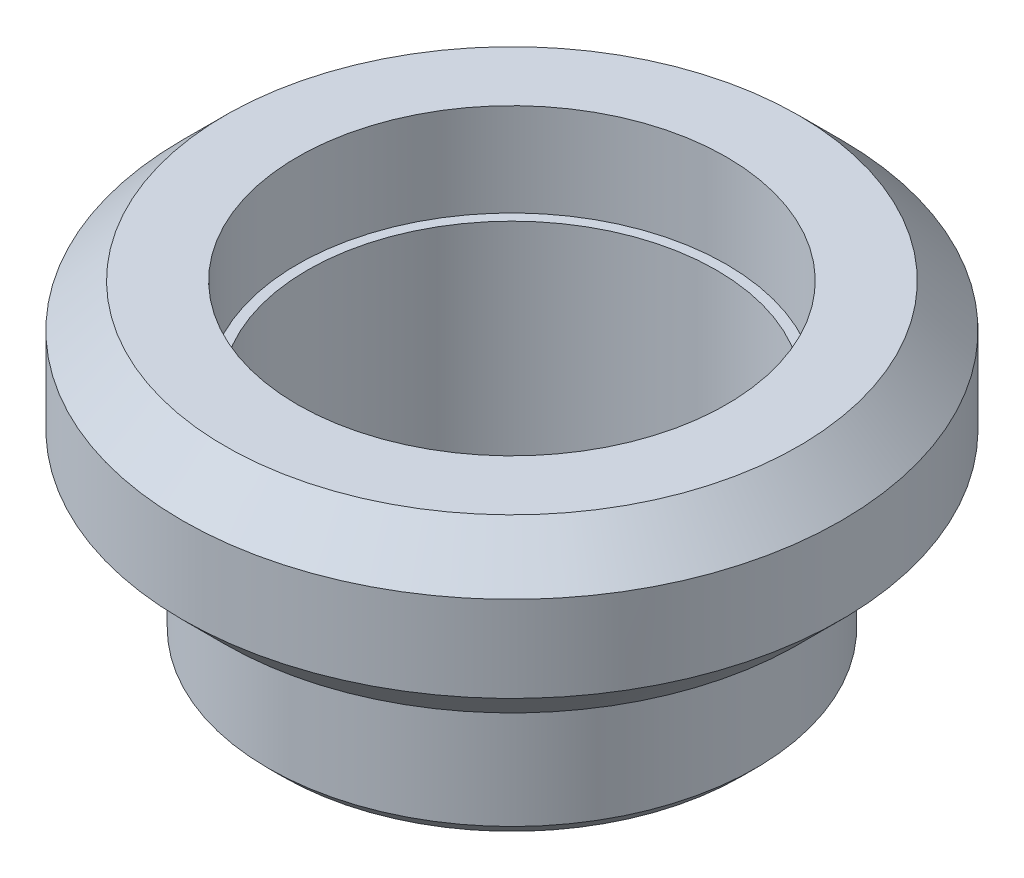
ISO-10303-21;
HEADER;
FILE_DESCRIPTION(('STEP AP214'),'2;1');
FILE_NAME('part.step','',(''),(''),'','','');
FILE_SCHEMA(('AUTOMOTIVE_DESIGN { 1 0 10303 214 1 1 1 1 }'));
ENDSEC;
DATA;
#1=APPLICATION_CONTEXT('core data for automotive mechanical design processes');
#2=APPLICATION_PROTOCOL_DEFINITION('international standard','automotive_design',2000,#1);
#3=PRODUCT_CONTEXT('',#1,'mechanical');
#4=PRODUCT('Part','Part','',(#3));
#5=PRODUCT_RELATED_PRODUCT_CATEGORY('part','',(#4));
#6=PRODUCT_DEFINITION_FORMATION('','',#4);
#7=PRODUCT_DEFINITION_CONTEXT('part definition',#1,'design');
#8=PRODUCT_DEFINITION('design','',#6,#7);
#9=PRODUCT_DEFINITION_SHAPE('','',#8);
#10=(LENGTH_UNIT() NAMED_UNIT(*) SI_UNIT(.MILLI.,.METRE.));
#11=(NAMED_UNIT(*) PLANE_ANGLE_UNIT() SI_UNIT($,.RADIAN.));
#12=(NAMED_UNIT(*) SI_UNIT($,.STERADIAN.) SOLID_ANGLE_UNIT());
#13=UNCERTAINTY_MEASURE_WITH_UNIT(LENGTH_MEASURE(1.E-05),#10,'distance_accuracy_value','');
#14=(GEOMETRIC_REPRESENTATION_CONTEXT(3) GLOBAL_UNCERTAINTY_ASSIGNED_CONTEXT((#13)) GLOBAL_UNIT_ASSIGNED_CONTEXT((#10,
#11,#12)) REPRESENTATION_CONTEXT('',''));
#15=CARTESIAN_POINT('',(0.,0.,0.));
#16=DIRECTION('',(0.,0.,1.));
#17=DIRECTION('',(1.,0.,0.));
#18=AXIS2_PLACEMENT_3D('',#15,#16,#17);
#19=CARTESIAN_POINT('',(0.,23.1,0.));
#20=DIRECTION('',(0.,1.,0.));
#21=DIRECTION('',(0.,0.,1.));
#22=AXIS2_PLACEMENT_3D('',#19,#20,#21);
#23=CYLINDRICAL_SURFACE('',#22,17.05);
#24=CARTESIAN_POINT('',(0.,1.,0.));
#25=DIRECTION('',(0.,1.,0.));
#26=DIRECTION('',(0.,0.,1.));
#27=AXIS2_PLACEMENT_3D('',#24,#25,#26);
#28=CIRCLE('',#27,17.05);
#29=CARTESIAN_POINT('',(0.,1.,17.05));
#30=VERTEX_POINT('',#29);
#31=EDGE_CURVE('E47',#30,#30,#28,.T.);
#32=ORIENTED_EDGE('',*,*,#31,.T.);
#33=EDGE_LOOP('',(#32));
#34=FACE_BOUND('',#33,.T.);
#35=CARTESIAN_POINT('',(0.,10.,0.));
#36=DIRECTION('',(0.,1.,0.));
#37=DIRECTION('',(0.,0.,1.));
#38=AXIS2_PLACEMENT_3D('',#35,#36,#37);
#39=CIRCLE('',#38,17.05);
#40=CARTESIAN_POINT('',(0.,10.,17.05));
#41=VERTEX_POINT('',#40);
#42=EDGE_CURVE('E66',#41,#41,#39,.T.);
#43=ORIENTED_EDGE('',*,*,#42,.F.);
#44=EDGE_LOOP('',(#43));
#45=FACE_BOUND('',#44,.T.);
#46=ADVANCED_FACE('F39',(#34,#45),#23,.T.);
#47=CARTESIAN_POINT('',(17.05,10.,0.));
#48=DIRECTION('',(0.,1.,0.));
#49=DIRECTION('',(0.,0.,1.));
#50=AXIS2_PLACEMENT_3D('',#47,#48,#49);
#51=PLANE('',#50);
#52=CARTESIAN_POINT('',(0.,10.,0.));
#53=DIRECTION('',(0.,1.,0.));
#54=DIRECTION('',(0.,0.,1.));
#55=AXIS2_PLACEMENT_3D('',#52,#53,#54);
#56=CIRCLE('',#55,20.05);
#57=CARTESIAN_POINT('',(0.,10.,20.05));
#58=VERTEX_POINT('',#57);
#59=EDGE_CURVE('E55',#58,#58,#56,.F.);
#60=ORIENTED_EDGE('',*,*,#59,.T.);
#61=EDGE_LOOP('',(#60));
#62=FACE_BOUND('',#61,.T.);
#63=ORIENTED_EDGE('',*,*,#42,.T.);
#64=EDGE_LOOP('',(#63));
#65=FACE_BOUND('',#64,.T.);
#66=ADVANCED_FACE('F111',(#62,#65),#51,.F.);
#67=CARTESIAN_POINT('',(0.,23.1,0.));
#68=DIRECTION('',(0.,1.,0.));
#69=DIRECTION('',(0.,0.,1.));
#70=AXIS2_PLACEMENT_3D('',#67,#68,#69);
#71=CYLINDRICAL_SURFACE('',#70,23.05);
#72=CARTESIAN_POINT('',(0.,13.,0.));
#73=DIRECTION('',(0.,1.,0.));
#74=DIRECTION('',(0.,0.,1.));
#75=AXIS2_PLACEMENT_3D('',#72,#73,#74);
#76=CIRCLE('',#75,23.05);
#77=CARTESIAN_POINT('',(0.,13.,23.05));
#78=VERTEX_POINT('',#77);
#79=EDGE_CURVE('E60',#78,#78,#76,.T.);
#80=ORIENTED_EDGE('',*,*,#79,.T.);
#81=EDGE_LOOP('',(#80));
#82=FACE_BOUND('',#81,.T.);
#83=CARTESIAN_POINT('',(0.,19.,0.));
#84=DIRECTION('',(0.,-1.,0.));
#85=DIRECTION('',(0.,0.,-1.));
#86=AXIS2_PLACEMENT_3D('',#83,#84,#85);
#87=CIRCLE('',#86,23.05);
#88=CARTESIAN_POINT('',(0.,19.,-23.05));
#89=VERTEX_POINT('',#88);
#90=EDGE_CURVE('E63',#89,#89,#87,.T.);
#91=ORIENTED_EDGE('',*,*,#90,.T.);
#92=EDGE_LOOP('',(#91));
#93=FACE_BOUND('',#92,.T.);
#94=ADVANCED_FACE('F104',(#82,#93),#71,.T.);
#95=CARTESIAN_POINT('',(15.,22.,0.));
#96=DIRECTION('',(0.,-1.,0.));
#97=DIRECTION('',(0.,0.,-1.));
#98=AXIS2_PLACEMENT_3D('',#95,#96,#97);
#99=PLANE('',#98);
#100=CARTESIAN_POINT('',(0.,22.,0.));
#101=DIRECTION('',(0.,-1.,0.));
#102=DIRECTION('',(0.,0.,-1.));
#103=AXIS2_PLACEMENT_3D('',#100,#101,#102);
#104=CIRCLE('',#103,20.05);
#105=CARTESIAN_POINT('',(0.,22.,-20.05));
#106=VERTEX_POINT('',#105);
#107=EDGE_CURVE('E51',#106,#106,#104,.F.);
#108=ORIENTED_EDGE('',*,*,#107,.T.);
#109=EDGE_LOOP('',(#108));
#110=FACE_BOUND('',#109,.T.);
#111=CARTESIAN_POINT('',(0.,22.,0.));
#112=DIRECTION('',(0.,1.,0.));
#113=DIRECTION('',(0.,0.,1.));
#114=AXIS2_PLACEMENT_3D('',#111,#112,#113);
#115=CIRCLE('',#114,15.);
#116=CARTESIAN_POINT('',(0.,22.,15.));
#117=VERTEX_POINT('',#116);
#118=EDGE_CURVE('E69',#117,#117,#115,.T.);
#119=ORIENTED_EDGE('',*,*,#118,.F.);
#120=EDGE_LOOP('',(#119));
#121=FACE_BOUND('',#120,.T.);
#122=ADVANCED_FACE('F99',(#110,#121),#99,.F.);
#123=CARTESIAN_POINT('',(0.,23.1,0.));
#124=DIRECTION('',(0.,1.,0.));
#125=DIRECTION('',(0.,0.,1.));
#126=AXIS2_PLACEMENT_3D('',#123,#124,#125);
#127=CYLINDRICAL_SURFACE('',#126,15.);
#128=CARTESIAN_POINT('',(0.,15.5,0.));
#129=DIRECTION('',(0.,1.,0.));
#130=DIRECTION('',(0.,0.,1.));
#131=AXIS2_PLACEMENT_3D('',#128,#129,#130);
#132=CIRCLE('',#131,15.);
#133=CARTESIAN_POINT('',(0.,15.5,15.));
#134=VERTEX_POINT('',#133);
#135=EDGE_CURVE('E72',#134,#134,#132,.T.);
#136=ORIENTED_EDGE('',*,*,#135,.F.);
#137=EDGE_LOOP('',(#136));
#138=FACE_BOUND('',#137,.T.);
#139=ORIENTED_EDGE('',*,*,#118,.T.);
#140=EDGE_LOOP('',(#139));
#141=FACE_BOUND('',#140,.T.);
#142=ADVANCED_FACE('F93',(#138,#141),#127,.F.);
#143=CARTESIAN_POINT('',(14.3,15.5,0.));
#144=DIRECTION('',(0.,-1.,0.));
#145=DIRECTION('',(0.,0.,-1.));
#146=AXIS2_PLACEMENT_3D('',#143,#144,#145);
#147=PLANE('',#146);
#148=CARTESIAN_POINT('',(0.,15.5,0.));
#149=DIRECTION('',(0.,1.,0.));
#150=DIRECTION('',(0.,0.,1.));
#151=AXIS2_PLACEMENT_3D('',#148,#149,#150);
#152=CIRCLE('',#151,14.3);
#153=CARTESIAN_POINT('',(0.,15.5,14.3));
#154=VERTEX_POINT('',#153);
#155=EDGE_CURVE('E75',#154,#154,#152,.T.);
#156=ORIENTED_EDGE('',*,*,#155,.F.);
#157=EDGE_LOOP('',(#156));
#158=FACE_BOUND('',#157,.T.);
#159=ORIENTED_EDGE('',*,*,#135,.T.);
#160=EDGE_LOOP('',(#159));
#161=FACE_BOUND('',#160,.T.);
#162=ADVANCED_FACE('F87',(#158,#161),#147,.F.);
#163=CARTESIAN_POINT('',(0.,23.1,0.));
#164=DIRECTION('',(0.,1.,0.));
#165=DIRECTION('',(0.,0.,1.));
#166=AXIS2_PLACEMENT_3D('',#163,#164,#165);
#167=CYLINDRICAL_SURFACE('',#166,14.3);
#168=CARTESIAN_POINT('',(0.,0.,0.));
#169=DIRECTION('',(0.,1.,0.));
#170=DIRECTION('',(0.,0.,1.));
#171=AXIS2_PLACEMENT_3D('',#168,#169,#170);
#172=CIRCLE('',#171,14.3);
#173=CARTESIAN_POINT('',(0.,0.,14.3));
#174=VERTEX_POINT('',#173);
#175=EDGE_CURVE('E78',#174,#174,#172,.T.);
#176=ORIENTED_EDGE('',*,*,#175,.F.);
#177=EDGE_LOOP('',(#176));
#178=FACE_BOUND('',#177,.T.);
#179=ORIENTED_EDGE('',*,*,#155,.T.);
#180=EDGE_LOOP('',(#179));
#181=FACE_BOUND('',#180,.T.);
#182=ADVANCED_FACE('F84',(#178,#181),#167,.F.);
#183=CARTESIAN_POINT('',(14.3,0.,0.));
#184=DIRECTION('',(0.,1.,0.));
#185=DIRECTION('',(0.,0.,1.));
#186=AXIS2_PLACEMENT_3D('',#183,#184,#185);
#187=PLANE('',#186);
#188=CARTESIAN_POINT('',(0.,0.,0.));
#189=DIRECTION('',(0.,1.,0.));
#190=DIRECTION('',(0.,0.,1.));
#191=AXIS2_PLACEMENT_3D('',#188,#189,#190);
#192=CIRCLE('',#191,16.05);
#193=CARTESIAN_POINT('',(0.,0.,16.05));
#194=VERTEX_POINT('',#193);
#195=EDGE_CURVE('E10',#194,#194,#192,.F.);
#196=ORIENTED_EDGE('',*,*,#195,.T.);
#197=EDGE_LOOP('',(#196));
#198=FACE_BOUND('',#197,.T.);
#199=ORIENTED_EDGE('',*,*,#175,.T.);
#200=EDGE_LOOP('',(#199));
#201=FACE_BOUND('',#200,.T.);
#202=ADVANCED_FACE('F82',(#198,#201),#187,.F.);
#203=CARTESIAN_POINT('',(0.,13.,0.));
#204=DIRECTION('',(0.,1.,0.));
#205=DIRECTION('',(0.,0.,1.));
#206=AXIS2_PLACEMENT_3D('',#203,#204,#205);
#207=CONICAL_SURFACE('',#206,23.05,0.78539816339745);
#208=ORIENTED_EDGE('',*,*,#59,.F.);
#209=EDGE_LOOP('',(#208));
#210=FACE_BOUND('',#209,.T.);
#211=ORIENTED_EDGE('',*,*,#79,.F.);
#212=EDGE_LOOP('',(#211));
#213=FACE_BOUND('',#212,.T.);
#214=ADVANCED_FACE('F126',(#210,#213),#207,.T.);
#215=CARTESIAN_POINT('',(0.,22.,0.));
#216=DIRECTION('',(0.,-1.,0.));
#217=DIRECTION('',(0.,0.,-1.));
#218=AXIS2_PLACEMENT_3D('',#215,#216,#217);
#219=CONICAL_SURFACE('',#218,20.05,0.785398163397444);
#220=ORIENTED_EDGE('',*,*,#90,.F.);
#221=EDGE_LOOP('',(#220));
#222=FACE_BOUND('',#221,.T.);
#223=ORIENTED_EDGE('',*,*,#107,.F.);
#224=EDGE_LOOP('',(#223));
#225=FACE_BOUND('',#224,.T.);
#226=ADVANCED_FACE('F130',(#222,#225),#219,.T.);
#227=CARTESIAN_POINT('',(0.,1.,0.));
#228=DIRECTION('',(0.,1.,0.));
#229=DIRECTION('',(0.,0.,1.));
#230=AXIS2_PLACEMENT_3D('',#227,#228,#229);
#231=CONICAL_SURFACE('',#230,17.05,0.78539816339745);
#232=ORIENTED_EDGE('',*,*,#195,.F.);
#233=EDGE_LOOP('',(#232));
#234=FACE_BOUND('',#233,.T.);
#235=ORIENTED_EDGE('',*,*,#31,.F.);
#236=EDGE_LOOP('',(#235));
#237=FACE_BOUND('',#236,.T.);
#238=ADVANCED_FACE('F42',(#234,#237),#231,.T.);
#239=CLOSED_SHELL('',(#46,#66,#94,#122,#142,#162,#182,#202,#214,#226,#238));
#240=MANIFOLD_SOLID_BREP('B2',#239);
#241=ADVANCED_BREP_SHAPE_REPRESENTATION('',(#18,#240),#14);
#242=SHAPE_DEFINITION_REPRESENTATION(#9,#241);
ENDSEC;
END-ISO-10303-21;
